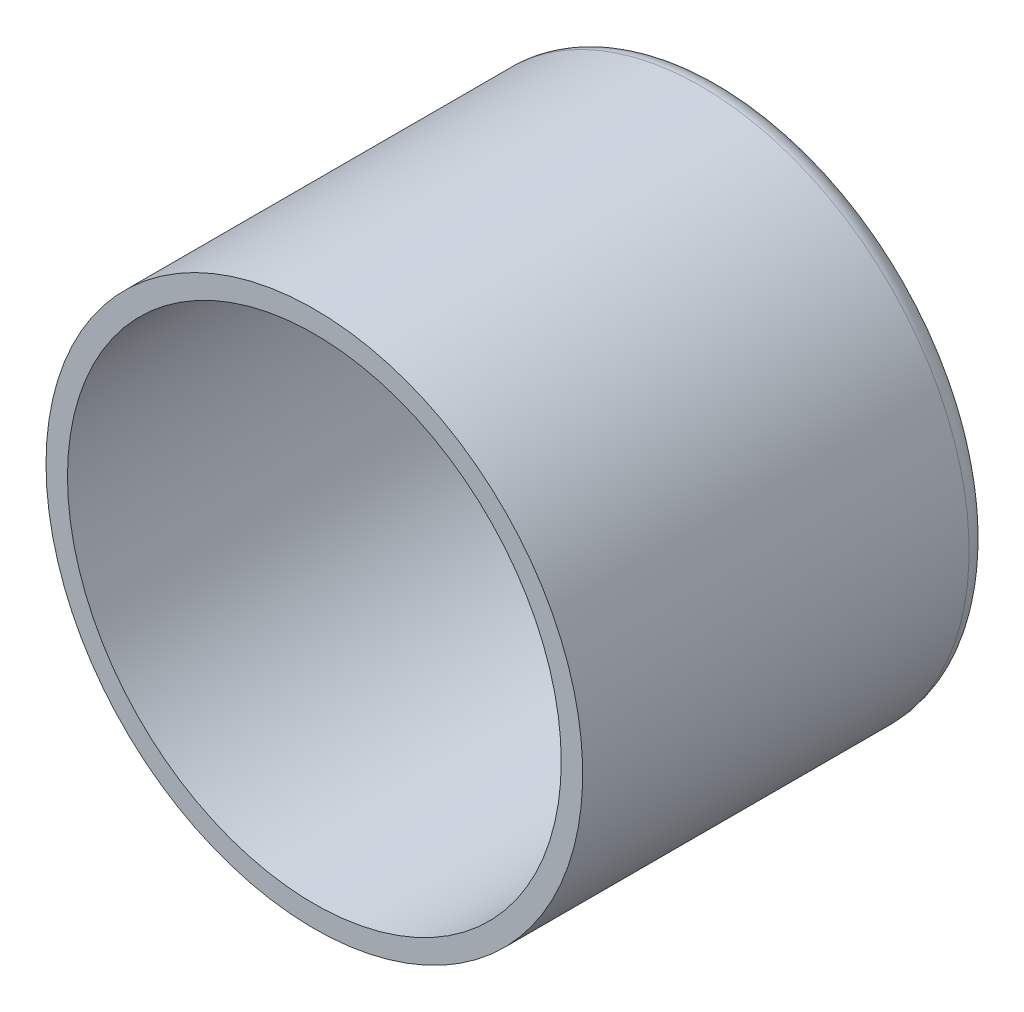
ISO-10303-21;
HEADER;
FILE_DESCRIPTION(('STEP AP214'),'2;1');
FILE_NAME('part.step','',(''),(''),'','','');
FILE_SCHEMA(('AUTOMOTIVE_DESIGN { 1 0 10303 214 1 1 1 1 }'));
ENDSEC;
DATA;
#1=APPLICATION_CONTEXT('core data for automotive mechanical design processes');
#2=APPLICATION_PROTOCOL_DEFINITION('international standard','automotive_design',2000,#1);
#3=PRODUCT_CONTEXT('',#1,'mechanical');
#4=PRODUCT('Part','Part','',(#3));
#5=PRODUCT_RELATED_PRODUCT_CATEGORY('part','',(#4));
#6=PRODUCT_DEFINITION_FORMATION('','',#4);
#7=PRODUCT_DEFINITION_CONTEXT('part definition',#1,'design');
#8=PRODUCT_DEFINITION('design','',#6,#7);
#9=PRODUCT_DEFINITION_SHAPE('','',#8);
#10=(LENGTH_UNIT() NAMED_UNIT(*) SI_UNIT(.MILLI.,.METRE.));
#11=(NAMED_UNIT(*) PLANE_ANGLE_UNIT() SI_UNIT($,.RADIAN.));
#12=(NAMED_UNIT(*) SI_UNIT($,.STERADIAN.) SOLID_ANGLE_UNIT());
#13=UNCERTAINTY_MEASURE_WITH_UNIT(LENGTH_MEASURE(1.E-05),#10,'distance_accuracy_value','');
#14=(GEOMETRIC_REPRESENTATION_CONTEXT(3) GLOBAL_UNCERTAINTY_ASSIGNED_CONTEXT((#13)) GLOBAL_UNIT_ASSIGNED_CONTEXT((#10,
#11,#12)) REPRESENTATION_CONTEXT('',''));
#15=CARTESIAN_POINT('',(0.,0.,0.));
#16=DIRECTION('',(0.,0.,1.));
#17=DIRECTION('',(1.,0.,0.));
#18=AXIS2_PLACEMENT_3D('',#15,#16,#17);
#19=CARTESIAN_POINT('',(0.,0.,40.));
#20=DIRECTION('',(0.,0.,-1.));
#21=DIRECTION('',(-1.,0.,0.));
#22=AXIS2_PLACEMENT_3D('',#19,#20,#21);
#23=CYLINDRICAL_SURFACE('',#22,25.);
#24=CARTESIAN_POINT('',(0.,0.,36.));
#25=DIRECTION('',(0.,0.,-1.));
#26=DIRECTION('',(-1.,0.,0.));
#27=AXIS2_PLACEMENT_3D('',#24,#25,#26);
#28=CIRCLE('',#27,25.);
#29=CARTESIAN_POINT('',(-25.,0.,36.));
#30=VERTEX_POINT('',#29);
#31=EDGE_CURVE('E68',#30,#30,#28,.T.);
#32=ORIENTED_EDGE('',*,*,#31,.T.);
#33=EDGE_LOOP('',(#32));
#34=FACE_BOUND('',#33,.T.);
#35=CARTESIAN_POINT('',(0.,0.,0.));
#36=DIRECTION('',(0.,0.,-1.));
#37=DIRECTION('',(-1.,0.,0.));
#38=AXIS2_PLACEMENT_3D('',#35,#36,#37);
#39=CIRCLE('',#38,25.);
#40=CARTESIAN_POINT('',(-25.,0.,0.));
#41=VERTEX_POINT('',#40);
#42=EDGE_CURVE('E56',#41,#41,#39,.F.);
#43=ORIENTED_EDGE('',*,*,#42,.T.);
#44=EDGE_LOOP('',(#43));
#45=FACE_BOUND('',#44,.T.);
#46=ADVANCED_FACE('F36',(#34,#45),#23,.T.);
#47=CARTESIAN_POINT('',(0.,0.,40.));
#48=DIRECTION('',(0.,0.,-1.));
#49=DIRECTION('',(-1.,0.,0.));
#50=AXIS2_PLACEMENT_3D('',#47,#48,#49);
#51=CYLINDRICAL_SURFACE('',#50,23.);
#52=CARTESIAN_POINT('',(0.,0.,36.));
#53=DIRECTION('',(0.,0.,-1.));
#54=DIRECTION('',(-1.,0.,0.));
#55=AXIS2_PLACEMENT_3D('',#52,#53,#54);
#56=CIRCLE('',#55,23.);
#57=CARTESIAN_POINT('',(-23.,0.,36.));
#58=VERTEX_POINT('',#57);
#59=EDGE_CURVE('E40',#58,#58,#56,.T.);
#60=ORIENTED_EDGE('',*,*,#59,.F.);
#61=EDGE_LOOP('',(#60));
#62=FACE_BOUND('',#61,.T.);
#63=CARTESIAN_POINT('',(0.,0.,2.));
#64=DIRECTION('',(0.,0.,-1.));
#65=DIRECTION('',(-1.,0.,0.));
#66=AXIS2_PLACEMENT_3D('',#63,#64,#65);
#67=CIRCLE('',#66,23.);
#68=CARTESIAN_POINT('',(-23.,0.,2.));
#69=VERTEX_POINT('',#68);
#70=EDGE_CURVE('E45',#69,#69,#67,.T.);
#71=ORIENTED_EDGE('',*,*,#70,.T.);
#72=EDGE_LOOP('',(#71));
#73=FACE_BOUND('',#72,.T.);
#74=ADVANCED_FACE('F80',(#62,#73),#51,.F.);
#75=CARTESIAN_POINT('',(0.,0.,0.));
#76=DIRECTION('',(0.,0.,-1.));
#77=DIRECTION('',(-1.,0.,0.));
#78=AXIS2_PLACEMENT_3D('',#75,#76,#77);
#79=PLANE('',#78);
#80=CARTESIAN_POINT('',(0.,0.,0.));
#81=DIRECTION('',(0.,0.,-1.));
#82=DIRECTION('',(-1.,0.,0.));
#83=AXIS2_PLACEMENT_3D('',#80,#81,#82);
#84=CIRCLE('',#83,21.);
#85=CARTESIAN_POINT('',(-21.,0.,0.));
#86=VERTEX_POINT('',#85);
#87=EDGE_CURVE('E50',#86,#86,#84,.F.);
#88=ORIENTED_EDGE('',*,*,#87,.T.);
#89=EDGE_LOOP('',(#88));
#90=FACE_BOUND('',#89,.T.);
#91=CARTESIAN_POINT('',(0.,0.,0.));
#92=DIRECTION('',(0.,0.,-1.));
#93=DIRECTION('',(-1.,0.,0.));
#94=AXIS2_PLACEMENT_3D('',#91,#92,#93);
#95=CIRCLE('',#94,16.5);
#96=CARTESIAN_POINT('',(-16.5,0.,0.));
#97=VERTEX_POINT('',#96);
#98=EDGE_CURVE('E64',#97,#97,#95,.T.);
#99=ORIENTED_EDGE('',*,*,#98,.T.);
#100=EDGE_LOOP('',(#99));
#101=FACE_BOUND('',#100,.T.);
#102=ADVANCED_FACE('F83',(#90,#101),#79,.F.);
#103=CARTESIAN_POINT('',(0.,0.,-2.));
#104=DIRECTION('',(0.,0.,-1.));
#105=DIRECTION('',(-1.,0.,0.));
#106=AXIS2_PLACEMENT_3D('',#103,#104,#105);
#107=PLANE('',#106);
#108=CARTESIAN_POINT('',(0.,0.,-2.));
#109=DIRECTION('',(0.,0.,-1.));
#110=DIRECTION('',(-1.,0.,0.));
#111=AXIS2_PLACEMENT_3D('',#108,#109,#110);
#112=CIRCLE('',#111,18.5);
#113=CARTESIAN_POINT('',(-18.5,0.,-2.));
#114=VERTEX_POINT('',#113);
#115=EDGE_CURVE('E10',#114,#114,#112,.F.);
#116=ORIENTED_EDGE('',*,*,#115,.T.);
#117=EDGE_LOOP('',(#116));
#118=FACE_BOUND('',#117,.T.);
#119=CARTESIAN_POINT('',(0.,0.,-2.));
#120=DIRECTION('',(0.,0.,-1.));
#121=DIRECTION('',(-1.,0.,0.));
#122=AXIS2_PLACEMENT_3D('',#119,#120,#121);
#123=CIRCLE('',#122,23.);
#124=CARTESIAN_POINT('',(-23.,0.,-2.));
#125=VERTEX_POINT('',#124);
#126=EDGE_CURVE('E60',#125,#125,#123,.T.);
#127=ORIENTED_EDGE('',*,*,#126,.T.);
#128=EDGE_LOOP('',(#127));
#129=FACE_BOUND('',#128,.T.);
#130=ADVANCED_FACE('F95',(#118,#129),#107,.T.);
#131=CARTESIAN_POINT('',(0.,0.,0.));
#132=DIRECTION('',(0.,0.,-1.));
#133=DIRECTION('',(-1.,0.,0.));
#134=AXIS2_PLACEMENT_3D('',#131,#132,#133);
#135=TOROIDAL_SURFACE('',#134,23.,2.);
#136=ORIENTED_EDGE('',*,*,#42,.F.);
#137=EDGE_LOOP('',(#136));
#138=FACE_BOUND('',#137,.T.);
#139=ORIENTED_EDGE('',*,*,#126,.F.);
#140=EDGE_LOOP('',(#139));
#141=FACE_BOUND('',#140,.T.);
#142=ADVANCED_FACE('F90',(#138,#141),#135,.T.);
#143=CARTESIAN_POINT('',(0.,0.,2.));
#144=DIRECTION('',(0.,0.,-1.));
#145=DIRECTION('',(-1.,0.,0.));
#146=AXIS2_PLACEMENT_3D('',#143,#144,#145);
#147=TOROIDAL_SURFACE('',#146,21.,2.);
#148=ORIENTED_EDGE('',*,*,#70,.F.);
#149=EDGE_LOOP('',(#148));
#150=FACE_BOUND('',#149,.T.);
#151=ORIENTED_EDGE('',*,*,#87,.F.);
#152=EDGE_LOOP('',(#151));
#153=FACE_BOUND('',#152,.T.);
#154=ADVANCED_FACE('F87',(#150,#153),#147,.F.);
#155=CARTESIAN_POINT('',(0.,0.,0.));
#156=DIRECTION('',(0.,0.,-1.));
#157=DIRECTION('',(-1.,0.,0.));
#158=AXIS2_PLACEMENT_3D('',#155,#156,#157);
#159=TOROIDAL_SURFACE('',#158,18.5,2.);
#160=ORIENTED_EDGE('',*,*,#115,.F.);
#161=EDGE_LOOP('',(#160));
#162=FACE_BOUND('',#161,.T.);
#163=ORIENTED_EDGE('',*,*,#98,.F.);
#164=EDGE_LOOP('',(#163));
#165=FACE_BOUND('',#164,.T.);
#166=ADVANCED_FACE('F38',(#162,#165),#159,.T.);
#167=CARTESIAN_POINT('',(0.,0.,36.));
#168=DIRECTION('',(0.,0.,-1.));
#169=DIRECTION('',(-1.,0.,0.));
#170=AXIS2_PLACEMENT_3D('',#167,#168,#169);
#171=PLANE('',#170);
#172=ORIENTED_EDGE('',*,*,#59,.T.);
#173=EDGE_LOOP('',(#172));
#174=FACE_BOUND('',#173,.T.);
#175=ORIENTED_EDGE('',*,*,#31,.F.);
#176=EDGE_LOOP('',(#175));
#177=FACE_BOUND('',#176,.T.);
#178=ADVANCED_FACE('F77',(#174,#177),#171,.F.);
#179=CLOSED_SHELL('',(#46,#74,#102,#130,#142,#154,#166,#178));
#180=MANIFOLD_SOLID_BREP('B2',#179);
#181=ADVANCED_BREP_SHAPE_REPRESENTATION('',(#18,#180),#14);
#182=SHAPE_DEFINITION_REPRESENTATION(#9,#181);
ENDSEC;
END-ISO-10303-21;
